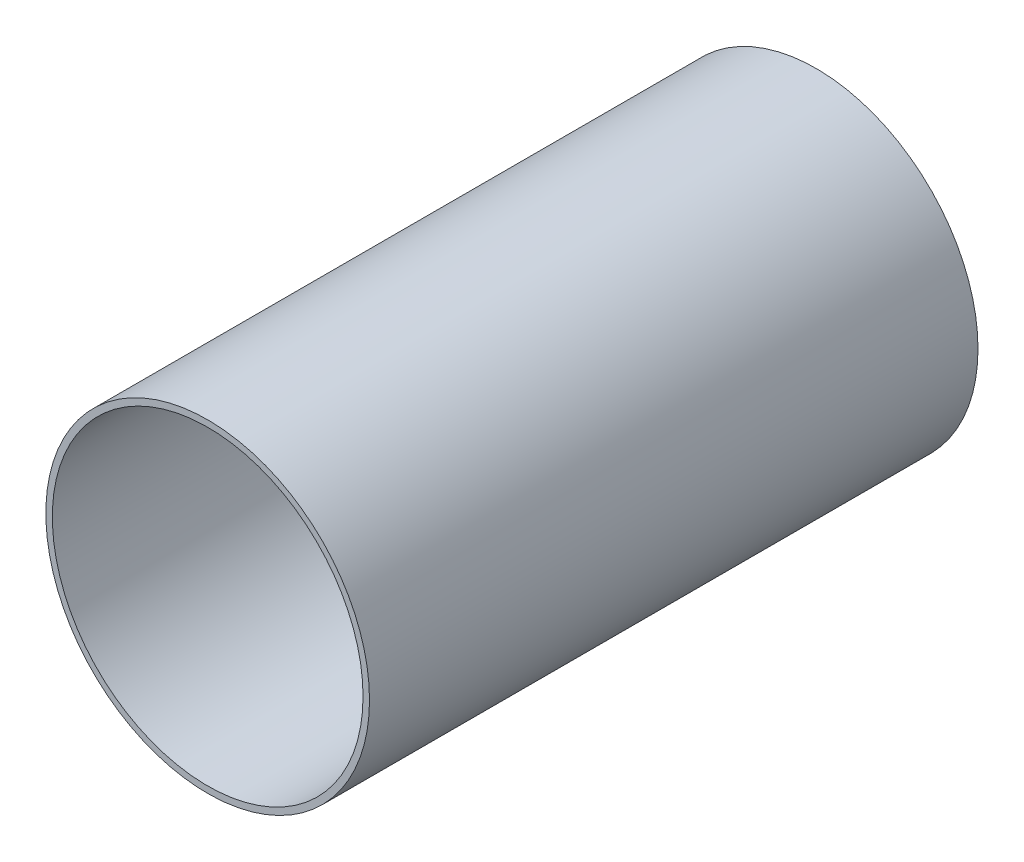
ISO-10303-21;
HEADER;
FILE_DESCRIPTION(('STEP AP214'),'2;1');
FILE_NAME('part.step','',(''),(''),'','','');
FILE_SCHEMA(('AUTOMOTIVE_DESIGN { 1 0 10303 214 1 1 1 1 }'));
ENDSEC;
DATA;
#1=APPLICATION_CONTEXT('core data for automotive mechanical design processes');
#2=APPLICATION_PROTOCOL_DEFINITION('international standard','automotive_design',2000,#1);
#3=PRODUCT_CONTEXT('',#1,'mechanical');
#4=PRODUCT('Part','Part','',(#3));
#5=PRODUCT_RELATED_PRODUCT_CATEGORY('part','',(#4));
#6=PRODUCT_DEFINITION_FORMATION('','',#4);
#7=PRODUCT_DEFINITION_CONTEXT('part definition',#1,'design');
#8=PRODUCT_DEFINITION('design','',#6,#7);
#9=PRODUCT_DEFINITION_SHAPE('','',#8);
#10=(LENGTH_UNIT() NAMED_UNIT(*) SI_UNIT(.MILLI.,.METRE.));
#11=(NAMED_UNIT(*) PLANE_ANGLE_UNIT() SI_UNIT($,.RADIAN.));
#12=(NAMED_UNIT(*) SI_UNIT($,.STERADIAN.) SOLID_ANGLE_UNIT());
#13=UNCERTAINTY_MEASURE_WITH_UNIT(LENGTH_MEASURE(1.E-05),#10,'distance_accuracy_value','');
#14=(GEOMETRIC_REPRESENTATION_CONTEXT(3) GLOBAL_UNCERTAINTY_ASSIGNED_CONTEXT((#13)) GLOBAL_UNIT_ASSIGNED_CONTEXT((#10,
#11,#12)) REPRESENTATION_CONTEXT('',''));
#15=CARTESIAN_POINT('',(0.,0.,0.));
#16=DIRECTION('',(0.,0.,1.));
#17=DIRECTION('',(1.,0.,0.));
#18=AXIS2_PLACEMENT_3D('',#15,#16,#17);
#19=CARTESIAN_POINT('',(0.,0.,298.45));
#20=DIRECTION('',(0.,0.,-1.));
#21=DIRECTION('',(-1.,0.,0.));
#22=AXIS2_PLACEMENT_3D('',#19,#20,#21);
#23=CYLINDRICAL_SURFACE('',#22,79.375);
#24=CARTESIAN_POINT('',(0.,0.,298.45));
#25=DIRECTION('',(0.,0.,1.));
#26=DIRECTION('',(1.,0.,0.));
#27=AXIS2_PLACEMENT_3D('',#24,#25,#26);
#28=CIRCLE('',#27,79.375);
#29=CARTESIAN_POINT('',(79.375,0.,298.45));
#30=VERTEX_POINT('',#29);
#31=EDGE_CURVE('E10',#30,#30,#28,.T.);
#32=ORIENTED_EDGE('',*,*,#31,.F.);
#33=EDGE_LOOP('',(#32));
#34=FACE_BOUND('',#33,.T.);
#35=CARTESIAN_POINT('',(0.,0.,0.));
#36=DIRECTION('',(0.,0.,1.));
#37=DIRECTION('',(1.,0.,0.));
#38=AXIS2_PLACEMENT_3D('',#35,#36,#37);
#39=CIRCLE('',#38,79.375);
#40=CARTESIAN_POINT('',(79.375,0.,0.));
#41=VERTEX_POINT('',#40);
#42=EDGE_CURVE('E33',#41,#41,#39,.T.);
#43=ORIENTED_EDGE('',*,*,#42,.T.);
#44=EDGE_LOOP('',(#43));
#45=FACE_BOUND('',#44,.T.);
#46=ADVANCED_FACE('F30',(#34,#45),#23,.T.);
#47=CARTESIAN_POINT('',(0.,0.,298.45));
#48=DIRECTION('',(0.,0.,1.));
#49=DIRECTION('',(1.,0.,0.));
#50=AXIS2_PLACEMENT_3D('',#47,#48,#49);
#51=PLANE('',#50);
#52=CARTESIAN_POINT('',(0.,0.,298.45));
#53=DIRECTION('',(0.,0.,1.));
#54=DIRECTION('',(1.,0.,0.));
#55=AXIS2_PLACEMENT_3D('',#52,#53,#54);
#56=CIRCLE('',#55,76.2);
#57=CARTESIAN_POINT('',(76.2,0.,298.45));
#58=VERTEX_POINT('',#57);
#59=EDGE_CURVE('E42',#58,#58,#56,.T.);
#60=ORIENTED_EDGE('',*,*,#59,.F.);
#61=EDGE_LOOP('',(#60));
#62=FACE_BOUND('',#61,.T.);
#63=ORIENTED_EDGE('',*,*,#31,.T.);
#64=EDGE_LOOP('',(#63));
#65=FACE_BOUND('',#64,.T.);
#66=ADVANCED_FACE('F57',(#62,#65),#51,.T.);
#67=CARTESIAN_POINT('',(0.,0.,0.));
#68=DIRECTION('',(0.,0.,1.));
#69=DIRECTION('',(1.,0.,0.));
#70=AXIS2_PLACEMENT_3D('',#67,#68,#69);
#71=PLANE('',#70);
#72=CARTESIAN_POINT('',(0.,0.,0.));
#73=DIRECTION('',(0.,0.,1.));
#74=DIRECTION('',(1.,0.,0.));
#75=AXIS2_PLACEMENT_3D('',#72,#73,#74);
#76=CIRCLE('',#75,76.2);
#77=CARTESIAN_POINT('',(76.2,0.,0.));
#78=VERTEX_POINT('',#77);
#79=EDGE_CURVE('E40',#78,#78,#76,.T.);
#80=ORIENTED_EDGE('',*,*,#79,.T.);
#81=EDGE_LOOP('',(#80));
#82=FACE_BOUND('',#81,.T.);
#83=ORIENTED_EDGE('',*,*,#42,.F.);
#84=EDGE_LOOP('',(#83));
#85=FACE_BOUND('',#84,.T.);
#86=ADVANCED_FACE('F48',(#82,#85),#71,.F.);
#87=CARTESIAN_POINT('',(0.,0.,0.));
#88=DIRECTION('',(0.,0.,1.));
#89=DIRECTION('',(1.,0.,0.));
#90=AXIS2_PLACEMENT_3D('',#87,#88,#89);
#91=CYLINDRICAL_SURFACE('',#90,76.2);
#92=ORIENTED_EDGE('',*,*,#79,.F.);
#93=EDGE_LOOP('',(#92));
#94=FACE_BOUND('',#93,.T.);
#95=ORIENTED_EDGE('',*,*,#59,.T.);
#96=EDGE_LOOP('',(#95));
#97=FACE_BOUND('',#96,.T.);
#98=ADVANCED_FACE('F51',(#94,#97),#91,.F.);
#99=CLOSED_SHELL('',(#46,#66,#86,#98));
#100=MANIFOLD_SOLID_BREP('B2',#99);
#101=ADVANCED_BREP_SHAPE_REPRESENTATION('',(#18,#100),#14);
#102=SHAPE_DEFINITION_REPRESENTATION(#9,#101);
ENDSEC;
END-ISO-10303-21;
